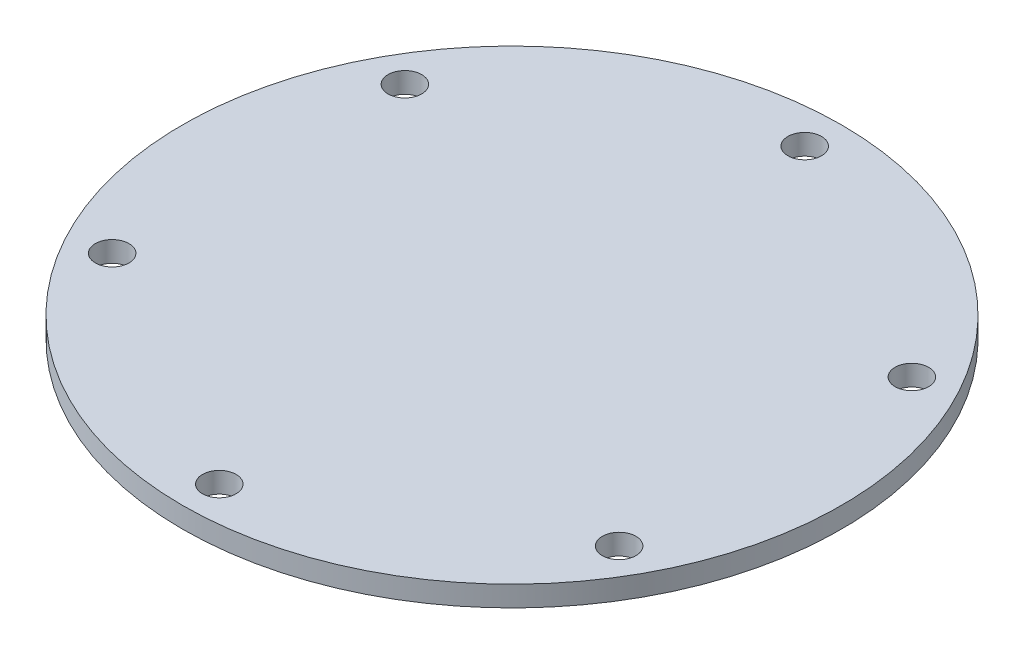
ISO-10303-21;
HEADER;
FILE_DESCRIPTION(('STEP AP214'),'2;1');
FILE_NAME('part.step','',(''),(''),'','','');
FILE_SCHEMA(('AUTOMOTIVE_DESIGN { 1 0 10303 214 1 1 1 1 }'));
ENDSEC;
DATA;
#1=APPLICATION_CONTEXT('core data for automotive mechanical design processes');
#2=APPLICATION_PROTOCOL_DEFINITION('international standard','automotive_design',2000,#1);
#3=PRODUCT_CONTEXT('',#1,'mechanical');
#4=PRODUCT('Part','Part','',(#3));
#5=PRODUCT_RELATED_PRODUCT_CATEGORY('part','',(#4));
#6=PRODUCT_DEFINITION_FORMATION('','',#4);
#7=PRODUCT_DEFINITION_CONTEXT('part definition',#1,'design');
#8=PRODUCT_DEFINITION('design','',#6,#7);
#9=PRODUCT_DEFINITION_SHAPE('','',#8);
#10=(LENGTH_UNIT() NAMED_UNIT(*) SI_UNIT(.MILLI.,.METRE.));
#11=(NAMED_UNIT(*) PLANE_ANGLE_UNIT() SI_UNIT($,.RADIAN.));
#12=(NAMED_UNIT(*) SI_UNIT($,.STERADIAN.) SOLID_ANGLE_UNIT());
#13=UNCERTAINTY_MEASURE_WITH_UNIT(LENGTH_MEASURE(1.E-05),#10,'distance_accuracy_value','');
#14=(GEOMETRIC_REPRESENTATION_CONTEXT(3) GLOBAL_UNCERTAINTY_ASSIGNED_CONTEXT((#13)) GLOBAL_UNIT_ASSIGNED_CONTEXT((#10,
#11,#12)) REPRESENTATION_CONTEXT('',''));
#15=CARTESIAN_POINT('',(0.,0.,0.));
#16=DIRECTION('',(0.,0.,1.));
#17=DIRECTION('',(1.,0.,0.));
#18=AXIS2_PLACEMENT_3D('',#15,#16,#17);
#19=CARTESIAN_POINT('',(0.,3.175,0.));
#20=DIRECTION('',(0.,-1.,0.));
#21=DIRECTION('',(0.,0.,-1.));
#22=AXIS2_PLACEMENT_3D('',#19,#20,#21);
#23=CYLINDRICAL_SURFACE('',#22,50.8);
#24=CARTESIAN_POINT('',(0.,3.175,0.));
#25=DIRECTION('',(0.,1.,0.));
#26=DIRECTION('',(0.,0.,1.));
#27=AXIS2_PLACEMENT_3D('',#24,#25,#26);
#28=CIRCLE('',#27,50.8);
#29=CARTESIAN_POINT('',(0.,3.175,50.8));
#30=VERTEX_POINT('',#29);
#31=EDGE_CURVE('E10',#30,#30,#28,.T.);
#32=ORIENTED_EDGE('',*,*,#31,.F.);
#33=EDGE_LOOP('',(#32));
#34=FACE_BOUND('',#33,.T.);
#35=CARTESIAN_POINT('',(0.,0.,0.));
#36=DIRECTION('',(0.,1.,0.));
#37=DIRECTION('',(0.,0.,1.));
#38=AXIS2_PLACEMENT_3D('',#35,#36,#37);
#39=CIRCLE('',#38,50.8);
#40=CARTESIAN_POINT('',(0.,0.,50.8));
#41=VERTEX_POINT('',#40);
#42=EDGE_CURVE('E36',#41,#41,#39,.T.);
#43=ORIENTED_EDGE('',*,*,#42,.T.);
#44=EDGE_LOOP('',(#43));
#45=FACE_BOUND('',#44,.T.);
#46=ADVANCED_FACE('F33',(#34,#45),#23,.T.);
#47=CARTESIAN_POINT('',(0.,3.175,0.));
#48=DIRECTION('',(0.,1.,0.));
#49=DIRECTION('',(0.,0.,1.));
#50=AXIS2_PLACEMENT_3D('',#47,#48,#49);
#51=PLANE('',#50);
#52=CARTESIAN_POINT('',(39.0749818476983,3.175,-22.5599512883495));
#53=DIRECTION('',(0.,1.,0.));
#54=DIRECTION('',(0.,0.,1.));
#55=AXIS2_PLACEMENT_3D('',#52,#53,#54);
#56=CIRCLE('',#55,2.5908);
#57=CARTESIAN_POINT('',(39.0749818476983,3.175,-19.9691512883495));
#58=VERTEX_POINT('',#57);
#59=EDGE_CURVE('E77',#58,#58,#56,.T.);
#60=ORIENTED_EDGE('',*,*,#59,.F.);
#61=EDGE_LOOP('',(#60));
#62=FACE_BOUND('',#61,.T.);
#63=CARTESIAN_POINT('',(39.0749818476993,3.175,22.5599512883479));
#64=DIRECTION('',(0.,1.,0.));
#65=DIRECTION('',(0.,0.,1.));
#66=AXIS2_PLACEMENT_3D('',#63,#64,#65);
#67=CIRCLE('',#66,2.5908);
#68=CARTESIAN_POINT('',(39.0749818476993,3.175,25.1507512883479));
#69=VERTEX_POINT('',#68);
#70=EDGE_CURVE('E71',#69,#69,#67,.T.);
#71=ORIENTED_EDGE('',*,*,#70,.F.);
#72=EDGE_LOOP('',(#71));
#73=FACE_BOUND('',#72,.T.);
#74=CARTESIAN_POINT('',(4.8919202022546E-13,3.175,45.1199025766973));
#75=DIRECTION('',(0.,1.,0.));
#76=DIRECTION('',(0.,0.,1.));
#77=AXIS2_PLACEMENT_3D('',#74,#75,#76);
#78=CIRCLE('',#77,2.5908);
#79=CARTESIAN_POINT('',(4.8919202022546E-13,3.175,47.7107025766973));
#80=VERTEX_POINT('',#79);
#81=EDGE_CURVE('E65',#80,#80,#78,.T.);
#82=ORIENTED_EDGE('',*,*,#81,.F.);
#83=EDGE_LOOP('',(#82));
#84=FACE_BOUND('',#83,.T.);
#85=CARTESIAN_POINT('',(-39.0749818476985,3.175,22.5599512883493));
#86=DIRECTION('',(0.,1.,0.));
#87=DIRECTION('',(0.,0.,1.));
#88=AXIS2_PLACEMENT_3D('',#85,#86,#87);
#89=CIRCLE('',#88,2.5908);
#90=CARTESIAN_POINT('',(-39.0749818476985,3.175,25.1507512883493));
#91=VERTEX_POINT('',#90);
#92=EDGE_CURVE('E59',#91,#91,#89,.T.);
#93=ORIENTED_EDGE('',*,*,#92,.F.);
#94=EDGE_LOOP('',(#93));
#95=FACE_BOUND('',#94,.T.);
#96=CARTESIAN_POINT('',(-39.0749818476991,3.175,-22.5599512883481));
#97=DIRECTION('',(0.,1.,0.));
#98=DIRECTION('',(0.,0.,1.));
#99=AXIS2_PLACEMENT_3D('',#96,#97,#98);
#100=CIRCLE('',#99,2.5908);
#101=CARTESIAN_POINT('',(-39.0749818476991,3.175,-19.9691512883481));
#102=VERTEX_POINT('',#101);
#103=EDGE_CURVE('E53',#102,#102,#100,.T.);
#104=ORIENTED_EDGE('',*,*,#103,.F.);
#105=EDGE_LOOP('',(#104));
#106=FACE_BOUND('',#105,.T.);
#107=CARTESIAN_POINT('',(-4.8919202022546E-13,3.175,-45.1199025766973));
#108=DIRECTION('',(0.,1.,0.));
#109=DIRECTION('',(0.,0.,1.));
#110=AXIS2_PLACEMENT_3D('',#107,#108,#109);
#111=CIRCLE('',#110,2.5908);
#112=CARTESIAN_POINT('',(-4.8919202022546E-13,3.175,-42.5291025766973));
#113=VERTEX_POINT('',#112);
#114=EDGE_CURVE('E47',#113,#113,#111,.T.);
#115=ORIENTED_EDGE('',*,*,#114,.F.);
#116=EDGE_LOOP('',(#115));
#117=FACE_BOUND('',#116,.T.);
#118=ORIENTED_EDGE('',*,*,#31,.T.);
#119=EDGE_LOOP('',(#118));
#120=FACE_BOUND('',#119,.T.);
#121=ADVANCED_FACE('F83',(#62,#73,#84,#95,#106,#117,#120),#51,.T.);
#122=CARTESIAN_POINT('',(0.,0.,0.));
#123=DIRECTION('',(0.,1.,0.));
#124=DIRECTION('',(0.,0.,1.));
#125=AXIS2_PLACEMENT_3D('',#122,#123,#124);
#126=PLANE('',#125);
#127=CARTESIAN_POINT('',(39.0749818476983,0.,-22.5599512883495));
#128=DIRECTION('',(0.,1.,0.));
#129=DIRECTION('',(0.,0.,1.));
#130=AXIS2_PLACEMENT_3D('',#127,#128,#129);
#131=CIRCLE('',#130,2.5908);
#132=CARTESIAN_POINT('',(39.0749818476983,0.,-19.9691512883495));
#133=VERTEX_POINT('',#132);
#134=EDGE_CURVE('E74',#133,#133,#131,.T.);
#135=ORIENTED_EDGE('',*,*,#134,.T.);
#136=EDGE_LOOP('',(#135));
#137=FACE_BOUND('',#136,.T.);
#138=CARTESIAN_POINT('',(39.0749818476993,0.,22.5599512883479));
#139=DIRECTION('',(0.,1.,0.));
#140=DIRECTION('',(0.,0.,1.));
#141=AXIS2_PLACEMENT_3D('',#138,#139,#140);
#142=CIRCLE('',#141,2.5908);
#143=CARTESIAN_POINT('',(39.0749818476993,0.,25.1507512883479));
#144=VERTEX_POINT('',#143);
#145=EDGE_CURVE('E68',#144,#144,#142,.T.);
#146=ORIENTED_EDGE('',*,*,#145,.T.);
#147=EDGE_LOOP('',(#146));
#148=FACE_BOUND('',#147,.T.);
#149=CARTESIAN_POINT('',(4.8919202022546E-13,0.,45.1199025766973));
#150=DIRECTION('',(0.,1.,0.));
#151=DIRECTION('',(0.,0.,1.));
#152=AXIS2_PLACEMENT_3D('',#149,#150,#151);
#153=CIRCLE('',#152,2.5908);
#154=CARTESIAN_POINT('',(4.8919202022546E-13,0.,47.7107025766973));
#155=VERTEX_POINT('',#154);
#156=EDGE_CURVE('E62',#155,#155,#153,.T.);
#157=ORIENTED_EDGE('',*,*,#156,.T.);
#158=EDGE_LOOP('',(#157));
#159=FACE_BOUND('',#158,.T.);
#160=CARTESIAN_POINT('',(-39.0749818476985,0.,22.5599512883493));
#161=DIRECTION('',(0.,1.,0.));
#162=DIRECTION('',(0.,0.,1.));
#163=AXIS2_PLACEMENT_3D('',#160,#161,#162);
#164=CIRCLE('',#163,2.5908);
#165=CARTESIAN_POINT('',(-39.0749818476985,0.,25.1507512883493));
#166=VERTEX_POINT('',#165);
#167=EDGE_CURVE('E56',#166,#166,#164,.T.);
#168=ORIENTED_EDGE('',*,*,#167,.T.);
#169=EDGE_LOOP('',(#168));
#170=FACE_BOUND('',#169,.T.);
#171=CARTESIAN_POINT('',(-39.0749818476991,0.,-22.5599512883481));
#172=DIRECTION('',(0.,1.,0.));
#173=DIRECTION('',(0.,0.,1.));
#174=AXIS2_PLACEMENT_3D('',#171,#172,#173);
#175=CIRCLE('',#174,2.5908);
#176=CARTESIAN_POINT('',(-39.0749818476991,0.,-19.9691512883481));
#177=VERTEX_POINT('',#176);
#178=EDGE_CURVE('E50',#177,#177,#175,.T.);
#179=ORIENTED_EDGE('',*,*,#178,.T.);
#180=EDGE_LOOP('',(#179));
#181=FACE_BOUND('',#180,.T.);
#182=CARTESIAN_POINT('',(-4.8919202022546E-13,0.,-45.1199025766973));
#183=DIRECTION('',(0.,1.,0.));
#184=DIRECTION('',(0.,0.,1.));
#185=AXIS2_PLACEMENT_3D('',#182,#183,#184);
#186=CIRCLE('',#185,2.5908);
#187=CARTESIAN_POINT('',(-4.8919202022546E-13,0.,-42.5291025766973));
#188=VERTEX_POINT('',#187);
#189=EDGE_CURVE('E43',#188,#188,#186,.T.);
#190=ORIENTED_EDGE('',*,*,#189,.T.);
#191=EDGE_LOOP('',(#190));
#192=FACE_BOUND('',#191,.T.);
#193=ORIENTED_EDGE('',*,*,#42,.F.);
#194=EDGE_LOOP('',(#193));
#195=FACE_BOUND('',#194,.T.);
#196=ADVANCED_FACE('F86',(#137,#148,#159,#170,#181,#192,#195),#126,.F.);
#197=CARTESIAN_POINT('',(-4.8919202022546E-13,3.175,-45.1199025766973));
#198=DIRECTION('',(0.,1.,0.));
#199=DIRECTION('',(0.,0.,1.));
#200=AXIS2_PLACEMENT_3D('',#197,#198,#199);
#201=CYLINDRICAL_SURFACE('',#200,2.5908);
#202=ORIENTED_EDGE('',*,*,#189,.F.);
#203=EDGE_LOOP('',(#202));
#204=FACE_BOUND('',#203,.T.);
#205=ORIENTED_EDGE('',*,*,#114,.T.);
#206=EDGE_LOOP('',(#205));
#207=FACE_BOUND('',#206,.T.);
#208=ADVANCED_FACE('F98',(#204,#207),#201,.F.);
#209=CARTESIAN_POINT('',(-39.0749818476991,3.175,-22.5599512883481));
#210=DIRECTION('',(0.,1.,0.));
#211=DIRECTION('',(0.,0.,1.));
#212=AXIS2_PLACEMENT_3D('',#209,#210,#211);
#213=CYLINDRICAL_SURFACE('',#212,2.5908);
#214=ORIENTED_EDGE('',*,*,#178,.F.);
#215=EDGE_LOOP('',(#214));
#216=FACE_BOUND('',#215,.T.);
#217=ORIENTED_EDGE('',*,*,#103,.T.);
#218=EDGE_LOOP('',(#217));
#219=FACE_BOUND('',#218,.T.);
#220=ADVANCED_FACE('F100',(#216,#219),#213,.F.);
#221=CARTESIAN_POINT('',(-39.0749818476985,3.175,22.5599512883493));
#222=DIRECTION('',(0.,1.,0.));
#223=DIRECTION('',(0.,0.,1.));
#224=AXIS2_PLACEMENT_3D('',#221,#222,#223);
#225=CYLINDRICAL_SURFACE('',#224,2.5908);
#226=ORIENTED_EDGE('',*,*,#167,.F.);
#227=EDGE_LOOP('',(#226));
#228=FACE_BOUND('',#227,.T.);
#229=ORIENTED_EDGE('',*,*,#92,.T.);
#230=EDGE_LOOP('',(#229));
#231=FACE_BOUND('',#230,.T.);
#232=ADVANCED_FACE('F107',(#228,#231),#225,.F.);
#233=CARTESIAN_POINT('',(4.8919202022546E-13,3.175,45.1199025766973));
#234=DIRECTION('',(0.,1.,0.));
#235=DIRECTION('',(0.,0.,1.));
#236=AXIS2_PLACEMENT_3D('',#233,#234,#235);
#237=CYLINDRICAL_SURFACE('',#236,2.5908);
#238=ORIENTED_EDGE('',*,*,#156,.F.);
#239=EDGE_LOOP('',(#238));
#240=FACE_BOUND('',#239,.T.);
#241=ORIENTED_EDGE('',*,*,#81,.T.);
#242=EDGE_LOOP('',(#241));
#243=FACE_BOUND('',#242,.T.);
#244=ADVANCED_FACE('F143',(#240,#243),#237,.F.);
#245=CARTESIAN_POINT('',(39.0749818476993,3.175,22.5599512883479));
#246=DIRECTION('',(0.,1.,0.));
#247=DIRECTION('',(0.,0.,1.));
#248=AXIS2_PLACEMENT_3D('',#245,#246,#247);
#249=CYLINDRICAL_SURFACE('',#248,2.5908);
#250=ORIENTED_EDGE('',*,*,#145,.F.);
#251=EDGE_LOOP('',(#250));
#252=FACE_BOUND('',#251,.T.);
#253=ORIENTED_EDGE('',*,*,#70,.T.);
#254=EDGE_LOOP('',(#253));
#255=FACE_BOUND('',#254,.T.);
#256=ADVANCED_FACE('F153',(#252,#255),#249,.F.);
#257=CARTESIAN_POINT('',(39.0749818476983,3.175,-22.5599512883495));
#258=DIRECTION('',(0.,1.,0.));
#259=DIRECTION('',(0.,0.,1.));
#260=AXIS2_PLACEMENT_3D('',#257,#258,#259);
#261=CYLINDRICAL_SURFACE('',#260,2.5908);
#262=ORIENTED_EDGE('',*,*,#134,.F.);
#263=EDGE_LOOP('',(#262));
#264=FACE_BOUND('',#263,.T.);
#265=ORIENTED_EDGE('',*,*,#59,.T.);
#266=EDGE_LOOP('',(#265));
#267=FACE_BOUND('',#266,.T.);
#268=ADVANCED_FACE('F81',(#264,#267),#261,.F.);
#269=CLOSED_SHELL('',(#46,#121,#196,#208,#220,#232,#244,#256,#268));
#270=MANIFOLD_SOLID_BREP('B2',#269);
#271=ADVANCED_BREP_SHAPE_REPRESENTATION('',(#18,#270),#14);
#272=SHAPE_DEFINITION_REPRESENTATION(#9,#271);
ENDSEC;
END-ISO-10303-21;
